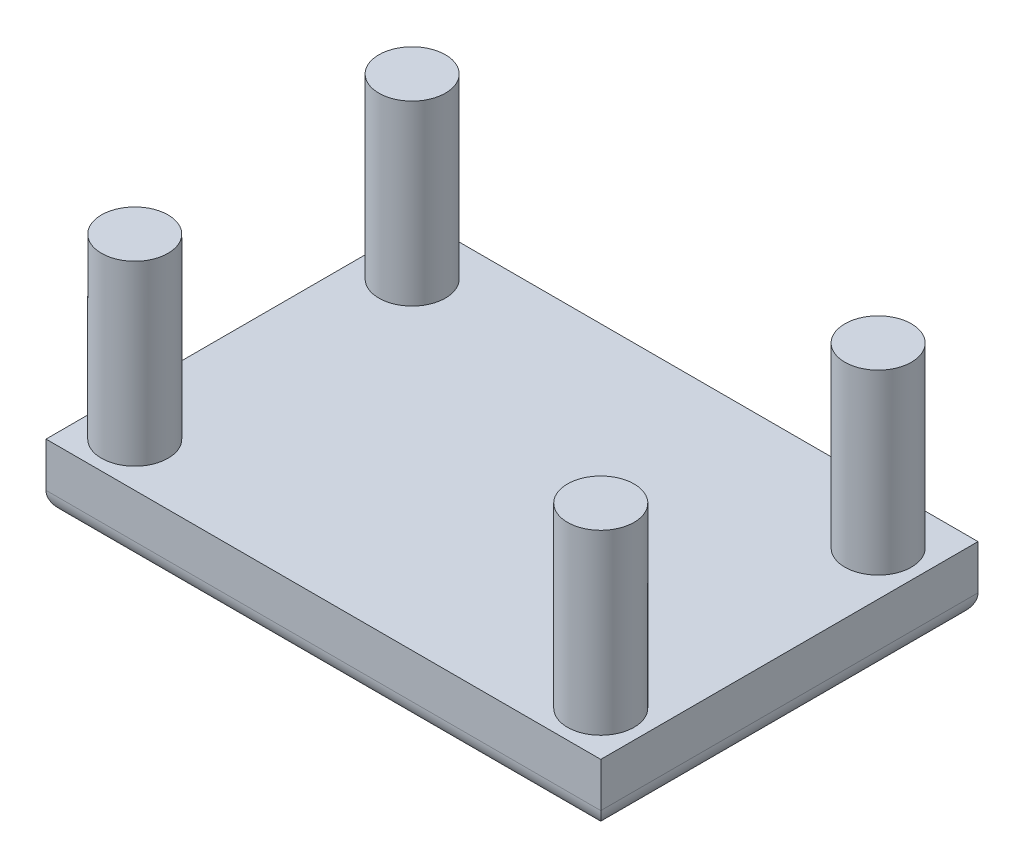
ISO-10303-21;
HEADER;
FILE_DESCRIPTION(('STEP AP214'),'2;1');
FILE_NAME('part.step','',(''),(''),'','','');
FILE_SCHEMA(('AUTOMOTIVE_DESIGN { 1 0 10303 214 1 1 1 1 }'));
ENDSEC;
DATA;
#1=APPLICATION_CONTEXT('core data for automotive mechanical design processes');
#2=APPLICATION_PROTOCOL_DEFINITION('international standard','automotive_design',2000,#1);
#3=PRODUCT_CONTEXT('',#1,'mechanical');
#4=PRODUCT('Part','Part','',(#3));
#5=PRODUCT_RELATED_PRODUCT_CATEGORY('part','',(#4));
#6=PRODUCT_DEFINITION_FORMATION('','',#4);
#7=PRODUCT_DEFINITION_CONTEXT('part definition',#1,'design');
#8=PRODUCT_DEFINITION('design','',#6,#7);
#9=PRODUCT_DEFINITION_SHAPE('','',#8);
#10=(LENGTH_UNIT() NAMED_UNIT(*) SI_UNIT(.MILLI.,.METRE.));
#11=(NAMED_UNIT(*) PLANE_ANGLE_UNIT() SI_UNIT($,.RADIAN.));
#12=(NAMED_UNIT(*) SI_UNIT($,.STERADIAN.) SOLID_ANGLE_UNIT());
#13=UNCERTAINTY_MEASURE_WITH_UNIT(LENGTH_MEASURE(1.E-05),#10,'distance_accuracy_value','');
#14=(GEOMETRIC_REPRESENTATION_CONTEXT(3) GLOBAL_UNCERTAINTY_ASSIGNED_CONTEXT((#13)) GLOBAL_UNIT_ASSIGNED_CONTEXT((#10,
#11,#12)) REPRESENTATION_CONTEXT('',''));
#15=CARTESIAN_POINT('',(0.,0.,0.));
#16=DIRECTION('',(0.,0.,1.));
#17=DIRECTION('',(1.,0.,0.));
#18=AXIS2_PLACEMENT_3D('',#15,#16,#17);
#19=CARTESIAN_POINT('',(12.5,3.,8.5));
#20=DIRECTION('',(-1.,0.,0.));
#21=DIRECTION('',(0.,0.,1.));
#22=AXIS2_PLACEMENT_3D('',#19,#20,#21);
#23=PLANE('',#22);
#24=DIRECTION('',(0.,-1.,0.));
#25=VECTOR('',#24,1.);
#26=CARTESIAN_POINT('',(12.5,3.,8.5));
#27=LINE('',#26,#25);
#28=CARTESIAN_POINT('',(12.5,3.,8.5));
#29=VERTEX_POINT('',#28);
#30=CARTESIAN_POINT('',(12.5,1.,8.5));
#31=VERTEX_POINT('',#30);
#32=EDGE_CURVE('E170',#29,#31,#27,.T.);
#33=ORIENTED_EDGE('',*,*,#32,.T.);
#34=DIRECTION('',(0.,0.,-1.));
#35=VECTOR('',#34,1.);
#36=CARTESIAN_POINT('',(12.5,1.,-8.5));
#37=LINE('',#36,#35);
#38=CARTESIAN_POINT('',(12.5,1.,-8.5));
#39=VERTEX_POINT('',#38);
#40=EDGE_CURVE('E11',#31,#39,#37,.T.);
#41=ORIENTED_EDGE('',*,*,#40,.T.);
#42=DIRECTION('',(0.,-1.,0.));
#43=VECTOR('',#42,1.);
#44=CARTESIAN_POINT('',(12.5,3.,-8.5));
#45=LINE('',#44,#43);
#46=CARTESIAN_POINT('',(12.5,3.,-8.5));
#47=VERTEX_POINT('',#46);
#48=EDGE_CURVE('E96',#47,#39,#45,.T.);
#49=ORIENTED_EDGE('',*,*,#48,.F.);
#50=DIRECTION('',(0.,0.,-1.));
#51=VECTOR('',#50,1.);
#52=CARTESIAN_POINT('',(12.5,3.,8.5));
#53=LINE('',#52,#51);
#54=EDGE_CURVE('E102',#29,#47,#53,.T.);
#55=ORIENTED_EDGE('',*,*,#54,.F.);
#56=EDGE_LOOP('',(#33,#41,#49,#55));
#57=FACE_BOUND('',#56,.T.);
#58=ADVANCED_FACE('F35',(#57),#23,.F.);
#59=CARTESIAN_POINT('',(-12.5,3.,-8.5));
#60=DIRECTION('',(0.,0.,1.));
#61=DIRECTION('',(1.,0.,0.));
#62=AXIS2_PLACEMENT_3D('',#59,#60,#61);
#63=PLANE('',#62);
#64=ORIENTED_EDGE('',*,*,#48,.T.);
#65=DIRECTION('',(-1.,0.,0.));
#66=VECTOR('',#65,1.);
#67=CARTESIAN_POINT('',(-12.5,1.,-8.5));
#68=LINE('',#67,#66);
#69=CARTESIAN_POINT('',(-12.5,1.,-8.5));
#70=VERTEX_POINT('',#69);
#71=EDGE_CURVE('E129',#39,#70,#68,.T.);
#72=ORIENTED_EDGE('',*,*,#71,.T.);
#73=DIRECTION('',(0.,-1.,0.));
#74=VECTOR('',#73,1.);
#75=CARTESIAN_POINT('',(-12.5,3.,-8.5));
#76=LINE('',#75,#74);
#77=CARTESIAN_POINT('',(-12.5,3.,-8.5));
#78=VERTEX_POINT('',#77);
#79=EDGE_CURVE('E98',#78,#70,#76,.T.);
#80=ORIENTED_EDGE('',*,*,#79,.F.);
#81=DIRECTION('',(-1.,0.,0.));
#82=VECTOR('',#81,1.);
#83=CARTESIAN_POINT('',(-12.5,3.,-8.5));
#84=LINE('',#83,#82);
#85=EDGE_CURVE('E91',#47,#78,#84,.T.);
#86=ORIENTED_EDGE('',*,*,#85,.F.);
#87=EDGE_LOOP('',(#64,#72,#80,#86));
#88=FACE_BOUND('',#87,.T.);
#89=ADVANCED_FACE('F93',(#88),#63,.F.);
#90=CARTESIAN_POINT('',(-12.5,3.,8.5));
#91=DIRECTION('',(1.,0.,0.));
#92=DIRECTION('',(0.,0.,-1.));
#93=AXIS2_PLACEMENT_3D('',#90,#91,#92);
#94=PLANE('',#93);
#95=ORIENTED_EDGE('',*,*,#79,.T.);
#96=DIRECTION('',(0.,0.,1.));
#97=VECTOR('',#96,1.);
#98=CARTESIAN_POINT('',(-12.5,1.,8.5));
#99=LINE('',#98,#97);
#100=CARTESIAN_POINT('',(-12.5,1.,8.5));
#101=VERTEX_POINT('',#100);
#102=EDGE_CURVE('E59',#70,#101,#99,.T.);
#103=ORIENTED_EDGE('',*,*,#102,.T.);
#104=DIRECTION('',(0.,-1.,0.));
#105=VECTOR('',#104,1.);
#106=CARTESIAN_POINT('',(-12.5,3.,8.5));
#107=LINE('',#106,#105);
#108=CARTESIAN_POINT('',(-12.5,3.,8.5));
#109=VERTEX_POINT('',#108);
#110=EDGE_CURVE('E117',#109,#101,#107,.T.);
#111=ORIENTED_EDGE('',*,*,#110,.F.);
#112=DIRECTION('',(0.,0.,1.));
#113=VECTOR('',#112,1.);
#114=CARTESIAN_POINT('',(-12.5,3.,8.5));
#115=LINE('',#114,#113);
#116=EDGE_CURVE('E101',#78,#109,#115,.T.);
#117=ORIENTED_EDGE('',*,*,#116,.F.);
#118=EDGE_LOOP('',(#95,#103,#111,#117));
#119=FACE_BOUND('',#118,.T.);
#120=ADVANCED_FACE('F180',(#119),#94,.F.);
#121=CARTESIAN_POINT('',(-12.5,3.,8.5));
#122=DIRECTION('',(0.,0.,-1.));
#123=DIRECTION('',(-1.,0.,0.));
#124=AXIS2_PLACEMENT_3D('',#121,#122,#123);
#125=PLANE('',#124);
#126=ORIENTED_EDGE('',*,*,#110,.T.);
#127=DIRECTION('',(1.,0.,0.));
#128=VECTOR('',#127,1.);
#129=CARTESIAN_POINT('',(12.5,1.,8.5));
#130=LINE('',#129,#128);
#131=EDGE_CURVE('E44',#101,#31,#130,.T.);
#132=ORIENTED_EDGE('',*,*,#131,.T.);
#133=ORIENTED_EDGE('',*,*,#32,.F.);
#134=DIRECTION('',(1.,0.,0.));
#135=VECTOR('',#134,1.);
#136=CARTESIAN_POINT('',(-12.5,3.,8.5));
#137=LINE('',#136,#135);
#138=EDGE_CURVE('E107',#109,#29,#137,.T.);
#139=ORIENTED_EDGE('',*,*,#138,.F.);
#140=EDGE_LOOP('',(#126,#132,#133,#139));
#141=FACE_BOUND('',#140,.T.);
#142=ADVANCED_FACE('F171',(#141),#125,.F.);
#143=CARTESIAN_POINT('',(0.,3.,0.));
#144=DIRECTION('',(0.,-1.,0.));
#145=DIRECTION('',(0.,0.,-1.));
#146=AXIS2_PLACEMENT_3D('',#143,#144,#145);
#147=PLANE('',#146);
#148=CARTESIAN_POINT('',(-10.5,3.,-5.99999989200001));
#149=DIRECTION('',(0.,-1.,0.));
#150=DIRECTION('',(0.,0.,-1.));
#151=AXIS2_PLACEMENT_3D('',#148,#149,#150);
#152=CIRCLE('',#151,1.5);
#153=CARTESIAN_POINT('',(-10.5,3.,-7.49999989200001));
#154=VERTEX_POINT('',#153);
#155=EDGE_CURVE('E126',#154,#154,#152,.F.);
#156=ORIENTED_EDGE('',*,*,#155,.F.);
#157=EDGE_LOOP('',(#156));
#158=FACE_BOUND('',#157,.T.);
#159=CARTESIAN_POINT('',(10.5,3.,-5.99999989200001));
#160=DIRECTION('',(0.,-1.,0.));
#161=DIRECTION('',(0.,0.,-1.));
#162=AXIS2_PLACEMENT_3D('',#159,#160,#161);
#163=CIRCLE('',#162,1.5);
#164=CARTESIAN_POINT('',(10.5,3.,-7.49999989200001));
#165=VERTEX_POINT('',#164);
#166=EDGE_CURVE('E123',#165,#165,#163,.F.);
#167=ORIENTED_EDGE('',*,*,#166,.F.);
#168=EDGE_LOOP('',(#167));
#169=FACE_BOUND('',#168,.T.);
#170=CARTESIAN_POINT('',(10.5,3.,6.5));
#171=DIRECTION('',(0.,-1.,0.));
#172=DIRECTION('',(0.,0.,-1.));
#173=AXIS2_PLACEMENT_3D('',#170,#171,#172);
#174=CIRCLE('',#173,1.5);
#175=CARTESIAN_POINT('',(10.5,3.,5.));
#176=VERTEX_POINT('',#175);
#177=EDGE_CURVE('E115',#176,#176,#174,.F.);
#178=ORIENTED_EDGE('',*,*,#177,.F.);
#179=EDGE_LOOP('',(#178));
#180=FACE_BOUND('',#179,.T.);
#181=CARTESIAN_POINT('',(-10.5,3.,6.5));
#182=DIRECTION('',(0.,-1.,0.));
#183=DIRECTION('',(0.,0.,-1.));
#184=AXIS2_PLACEMENT_3D('',#181,#182,#183);
#185=CIRCLE('',#184,1.5);
#186=CARTESIAN_POINT('',(-10.5,3.,5.));
#187=VERTEX_POINT('',#186);
#188=EDGE_CURVE('E112',#187,#187,#185,.F.);
#189=ORIENTED_EDGE('',*,*,#188,.F.);
#190=EDGE_LOOP('',(#189));
#191=FACE_BOUND('',#190,.T.);
#192=ORIENTED_EDGE('',*,*,#54,.T.);
#193=ORIENTED_EDGE('',*,*,#85,.T.);
#194=ORIENTED_EDGE('',*,*,#116,.T.);
#195=ORIENTED_EDGE('',*,*,#138,.T.);
#196=EDGE_LOOP('',(#192,#193,#194,#195));
#197=FACE_BOUND('',#196,.T.);
#198=ADVANCED_FACE('F105',(#158,#169,#180,#191,#197),#147,.F.);
#199=CARTESIAN_POINT('',(0.,0.,0.));
#200=DIRECTION('',(0.,-1.,0.));
#201=DIRECTION('',(0.,0.,-1.));
#202=AXIS2_PLACEMENT_3D('',#199,#200,#201);
#203=PLANE('',#202);
#204=DIRECTION('',(0.,0.,1.));
#205=VECTOR('',#204,1.);
#206=CARTESIAN_POINT('',(-11.5,0.,-8.5));
#207=LINE('',#206,#205);
#208=CARTESIAN_POINT('',(-11.5,0.,7.5));
#209=VERTEX_POINT('',#208);
#210=CARTESIAN_POINT('',(-11.5,0.,-7.5));
#211=VERTEX_POINT('',#210);
#212=EDGE_CURVE('E135',#209,#211,#207,.F.);
#213=ORIENTED_EDGE('',*,*,#212,.T.);
#214=DIRECTION('',(-1.,0.,0.));
#215=VECTOR('',#214,1.);
#216=CARTESIAN_POINT('',(12.5,0.,-7.5));
#217=LINE('',#216,#215);
#218=CARTESIAN_POINT('',(11.5,0.,-7.5));
#219=VERTEX_POINT('',#218);
#220=EDGE_CURVE('E137',#211,#219,#217,.F.);
#221=ORIENTED_EDGE('',*,*,#220,.T.);
#222=DIRECTION('',(0.,0.,-1.));
#223=VECTOR('',#222,1.);
#224=CARTESIAN_POINT('',(11.5,0.,8.5));
#225=LINE('',#224,#223);
#226=CARTESIAN_POINT('',(11.5,0.,7.5));
#227=VERTEX_POINT('',#226);
#228=EDGE_CURVE('E131',#219,#227,#225,.F.);
#229=ORIENTED_EDGE('',*,*,#228,.T.);
#230=DIRECTION('',(1.,0.,0.));
#231=VECTOR('',#230,1.);
#232=CARTESIAN_POINT('',(-12.5,0.,7.5));
#233=LINE('',#232,#231);
#234=EDGE_CURVE('E133',#227,#209,#233,.F.);
#235=ORIENTED_EDGE('',*,*,#234,.T.);
#236=EDGE_LOOP('',(#213,#221,#229,#235));
#237=FACE_BOUND('',#236,.T.);
#238=ADVANCED_FACE('F237',(#237),#203,.T.);
#239=CARTESIAN_POINT('',(-10.5,11.,6.5));
#240=DIRECTION('',(0.,-1.,0.));
#241=DIRECTION('',(0.,0.,-1.));
#242=AXIS2_PLACEMENT_3D('',#239,#240,#241);
#243=CYLINDRICAL_SURFACE('',#242,1.5);
#244=CARTESIAN_POINT('',(-10.5,11.,6.5));
#245=DIRECTION('',(0.,1.,0.));
#246=DIRECTION('',(0.,0.,1.));
#247=AXIS2_PLACEMENT_3D('',#244,#245,#246);
#248=CIRCLE('',#247,1.5);
#249=CARTESIAN_POINT('',(-10.5,11.,8.));
#250=VERTEX_POINT('',#249);
#251=EDGE_CURVE('E109',#250,#250,#248,.T.);
#252=ORIENTED_EDGE('',*,*,#251,.F.);
#253=EDGE_LOOP('',(#252));
#254=FACE_BOUND('',#253,.T.);
#255=ORIENTED_EDGE('',*,*,#188,.T.);
#256=EDGE_LOOP('',(#255));
#257=FACE_BOUND('',#256,.T.);
#258=ADVANCED_FACE('F233',(#254,#257),#243,.T.);
#259=CARTESIAN_POINT('',(-10.5,11.,6.5));
#260=DIRECTION('',(0.,1.,0.));
#261=DIRECTION('',(0.,0.,1.));
#262=AXIS2_PLACEMENT_3D('',#259,#260,#261);
#263=PLANE('',#262);
#264=ORIENTED_EDGE('',*,*,#251,.T.);
#265=EDGE_LOOP('',(#264));
#266=FACE_BOUND('',#265,.T.);
#267=ADVANCED_FACE('F229',(#266),#263,.T.);
#268=CARTESIAN_POINT('',(10.5,11.,6.5));
#269=DIRECTION('',(0.,-1.,0.));
#270=DIRECTION('',(0.,0.,-1.));
#271=AXIS2_PLACEMENT_3D('',#268,#269,#270);
#272=CYLINDRICAL_SURFACE('',#271,1.5);
#273=CARTESIAN_POINT('',(10.5,11.,6.5));
#274=DIRECTION('',(0.,1.,0.));
#275=DIRECTION('',(0.,0.,-1.));
#276=AXIS2_PLACEMENT_3D('',#273,#274,#275);
#277=CIRCLE('',#276,1.5);
#278=CARTESIAN_POINT('',(10.5,11.,5.));
#279=VERTEX_POINT('',#278);
#280=EDGE_CURVE('E161',#279,#279,#277,.T.);
#281=ORIENTED_EDGE('',*,*,#280,.F.);
#282=EDGE_LOOP('',(#281));
#283=FACE_BOUND('',#282,.T.);
#284=ORIENTED_EDGE('',*,*,#177,.T.);
#285=EDGE_LOOP('',(#284));
#286=FACE_BOUND('',#285,.T.);
#287=ADVANCED_FACE('F225',(#283,#286),#272,.T.);
#288=CARTESIAN_POINT('',(10.5,11.,6.5));
#289=DIRECTION('',(0.,-1.,0.));
#290=DIRECTION('',(0.,0.,-1.));
#291=AXIS2_PLACEMENT_3D('',#288,#289,#290);
#292=PLANE('',#291);
#293=ORIENTED_EDGE('',*,*,#280,.T.);
#294=EDGE_LOOP('',(#293));
#295=FACE_BOUND('',#294,.T.);
#296=ADVANCED_FACE('F221',(#295),#292,.F.);
#297=CARTESIAN_POINT('',(10.5,11.,-5.99999989200001));
#298=DIRECTION('',(0.,-1.,0.));
#299=DIRECTION('',(0.,0.,-1.));
#300=AXIS2_PLACEMENT_3D('',#297,#298,#299);
#301=CYLINDRICAL_SURFACE('',#300,1.5);
#302=CARTESIAN_POINT('',(10.5,11.,-5.99999989200001));
#303=DIRECTION('',(0.,1.,0.));
#304=DIRECTION('',(0.,0.,1.));
#305=AXIS2_PLACEMENT_3D('',#302,#303,#304);
#306=CIRCLE('',#305,1.5);
#307=CARTESIAN_POINT('',(10.5,11.,-4.49999989200001));
#308=VERTEX_POINT('',#307);
#309=EDGE_CURVE('E156',#308,#308,#306,.T.);
#310=ORIENTED_EDGE('',*,*,#309,.F.);
#311=EDGE_LOOP('',(#310));
#312=FACE_BOUND('',#311,.T.);
#313=ORIENTED_EDGE('',*,*,#166,.T.);
#314=EDGE_LOOP('',(#313));
#315=FACE_BOUND('',#314,.T.);
#316=ADVANCED_FACE('F217',(#312,#315),#301,.T.);
#317=CARTESIAN_POINT('',(10.5,11.,-5.99999989200001));
#318=DIRECTION('',(0.,1.,0.));
#319=DIRECTION('',(0.,0.,1.));
#320=AXIS2_PLACEMENT_3D('',#317,#318,#319);
#321=PLANE('',#320);
#322=ORIENTED_EDGE('',*,*,#309,.T.);
#323=EDGE_LOOP('',(#322));
#324=FACE_BOUND('',#323,.T.);
#325=ADVANCED_FACE('F211',(#324),#321,.T.);
#326=CARTESIAN_POINT('',(-10.5,11.,-5.99999989200001));
#327=DIRECTION('',(0.,-1.,0.));
#328=DIRECTION('',(0.,0.,-1.));
#329=AXIS2_PLACEMENT_3D('',#326,#327,#328);
#330=CYLINDRICAL_SURFACE('',#329,1.5);
#331=CARTESIAN_POINT('',(-10.5,11.,-5.99999989200001));
#332=DIRECTION('',(0.,1.,0.));
#333=DIRECTION('',(0.,0.,-1.));
#334=AXIS2_PLACEMENT_3D('',#331,#332,#333);
#335=CIRCLE('',#334,1.5);
#336=CARTESIAN_POINT('',(-10.5,11.,-7.49999989200001));
#337=VERTEX_POINT('',#336);
#338=EDGE_CURVE('E151',#337,#337,#335,.T.);
#339=ORIENTED_EDGE('',*,*,#338,.F.);
#340=EDGE_LOOP('',(#339));
#341=FACE_BOUND('',#340,.T.);
#342=ORIENTED_EDGE('',*,*,#155,.T.);
#343=EDGE_LOOP('',(#342));
#344=FACE_BOUND('',#343,.T.);
#345=ADVANCED_FACE('F206',(#341,#344),#330,.T.);
#346=CARTESIAN_POINT('',(-10.5,11.,-5.99999989200001));
#347=DIRECTION('',(0.,-1.,0.));
#348=DIRECTION('',(0.,0.,-1.));
#349=AXIS2_PLACEMENT_3D('',#346,#347,#348);
#350=PLANE('',#349);
#351=ORIENTED_EDGE('',*,*,#338,.T.);
#352=EDGE_LOOP('',(#351));
#353=FACE_BOUND('',#352,.T.);
#354=ADVANCED_FACE('F202',(#353),#350,.F.);
#355=CARTESIAN_POINT('',(-12.5,1.,7.5));
#356=DIRECTION('',(-1.,0.,0.));
#357=DIRECTION('',(0.,0.,1.));
#358=AXIS2_PLACEMENT_3D('',#355,#356,#357);
#359=CYLINDRICAL_SURFACE('',#358,1.);
#360=CARTESIAN_POINT('',(-11.5,1.,7.5));
#361=DIRECTION('',(-0.707106781186547,0.,-0.707106781186547));
#362=DIRECTION('',(-0.707106781186547,0.,0.707106781186547));
#363=AXIS2_PLACEMENT_3D('',#360,#361,#362);
#364=ELLIPSE('',#363,1.41421356237309,1.);
#365=EDGE_CURVE('E145',#209,#101,#364,.T.);
#366=ORIENTED_EDGE('',*,*,#365,.F.);
#367=ORIENTED_EDGE('',*,*,#234,.F.);
#368=CARTESIAN_POINT('',(11.5,1.,7.5));
#369=DIRECTION('',(-0.707106781186547,0.,0.707106781186547));
#370=DIRECTION('',(0.707106781186547,0.,0.707106781186547));
#371=AXIS2_PLACEMENT_3D('',#368,#369,#370);
#372=ELLIPSE('',#371,1.41421356237309,1.);
#373=EDGE_CURVE('E39',#31,#227,#372,.F.);
#374=ORIENTED_EDGE('',*,*,#373,.F.);
#375=ORIENTED_EDGE('',*,*,#131,.F.);
#376=EDGE_LOOP('',(#366,#367,#374,#375));
#377=FACE_BOUND('',#376,.T.);
#378=ADVANCED_FACE('F37',(#377),#359,.T.);
#379=CARTESIAN_POINT('',(11.5,1.,8.5));
#380=DIRECTION('',(0.,0.,1.));
#381=DIRECTION('',(1.,0.,0.));
#382=AXIS2_PLACEMENT_3D('',#379,#380,#381);
#383=CYLINDRICAL_SURFACE('',#382,1.);
#384=ORIENTED_EDGE('',*,*,#373,.T.);
#385=ORIENTED_EDGE('',*,*,#228,.F.);
#386=CARTESIAN_POINT('',(11.5,1.,-7.5));
#387=DIRECTION('',(0.707106781186547,0.,0.707106781186547));
#388=DIRECTION('',(-0.707106781186547,0.,0.707106781186547));
#389=AXIS2_PLACEMENT_3D('',#386,#387,#388);
#390=ELLIPSE('',#389,1.41421356237309,1.);
#391=EDGE_CURVE('E144',#39,#219,#390,.F.);
#392=ORIENTED_EDGE('',*,*,#391,.F.);
#393=ORIENTED_EDGE('',*,*,#40,.F.);
#394=EDGE_LOOP('',(#384,#385,#392,#393));
#395=FACE_BOUND('',#394,.T.);
#396=ADVANCED_FACE('F174',(#395),#383,.T.);
#397=CARTESIAN_POINT('',(-11.5,1.,8.5));
#398=DIRECTION('',(0.,0.,-1.));
#399=DIRECTION('',(-1.,0.,0.));
#400=AXIS2_PLACEMENT_3D('',#397,#398,#399);
#401=CYLINDRICAL_SURFACE('',#400,1.);
#402=ORIENTED_EDGE('',*,*,#365,.T.);
#403=ORIENTED_EDGE('',*,*,#102,.F.);
#404=CARTESIAN_POINT('',(-11.5,1.,-7.5));
#405=DIRECTION('',(0.707106781186547,0.,-0.707106781186547));
#406=DIRECTION('',(-0.707106781186547,0.,-0.707106781186547));
#407=AXIS2_PLACEMENT_3D('',#404,#405,#406);
#408=ELLIPSE('',#407,1.41421356237309,1.);
#409=EDGE_CURVE('E142',#211,#70,#408,.T.);
#410=ORIENTED_EDGE('',*,*,#409,.F.);
#411=ORIENTED_EDGE('',*,*,#212,.F.);
#412=EDGE_LOOP('',(#402,#403,#410,#411));
#413=FACE_BOUND('',#412,.T.);
#414=ADVANCED_FACE('F196',(#413),#401,.T.);
#415=CARTESIAN_POINT('',(-12.5,1.,-7.5));
#416=DIRECTION('',(1.,0.,0.));
#417=DIRECTION('',(0.,0.,-1.));
#418=AXIS2_PLACEMENT_3D('',#415,#416,#417);
#419=CYLINDRICAL_SURFACE('',#418,1.);
#420=ORIENTED_EDGE('',*,*,#391,.T.);
#421=ORIENTED_EDGE('',*,*,#220,.F.);
#422=ORIENTED_EDGE('',*,*,#409,.T.);
#423=ORIENTED_EDGE('',*,*,#71,.F.);
#424=EDGE_LOOP('',(#420,#421,#422,#423));
#425=FACE_BOUND('',#424,.T.);
#426=ADVANCED_FACE('F178',(#425),#419,.T.);
#427=CLOSED_SHELL('',(#58,#89,#120,#142,#198,#238,#258,#267,#287,#296,#316,#325,#345,#354,#378,
#396,#414,#426));
#428=MANIFOLD_SOLID_BREP('B2',#427);
#429=ADVANCED_BREP_SHAPE_REPRESENTATION('',(#18,#428),#14);
#430=SHAPE_DEFINITION_REPRESENTATION(#9,#429);
ENDSEC;
END-ISO-10303-21;
